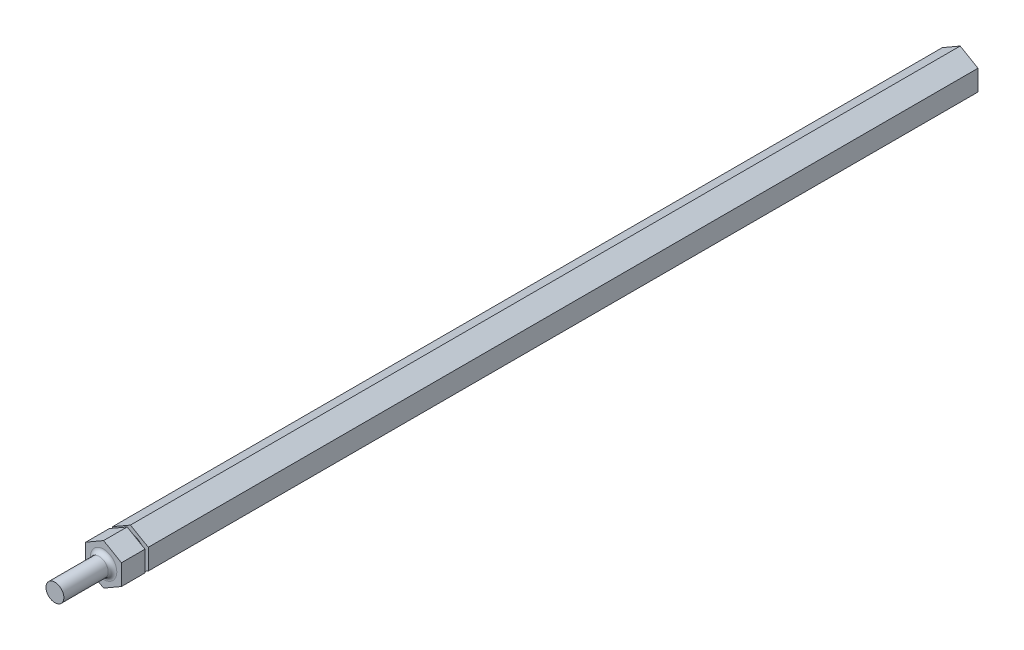
ISO-10303-21;
HEADER;
FILE_DESCRIPTION(('STEP AP214'),'2;1');
FILE_NAME('part.step','',(''),(''),'','','');
FILE_SCHEMA(('AUTOMOTIVE_DESIGN { 1 0 10303 214 1 1 1 1 }'));
ENDSEC;
DATA;
#1=APPLICATION_CONTEXT('core data for automotive mechanical design processes');
#2=APPLICATION_PROTOCOL_DEFINITION('international standard','automotive_design',2000,#1);
#3=PRODUCT_CONTEXT('',#1,'mechanical');
#4=PRODUCT('Part','Part','',(#3));
#5=PRODUCT_RELATED_PRODUCT_CATEGORY('part','',(#4));
#6=PRODUCT_DEFINITION_FORMATION('','',#4);
#7=PRODUCT_DEFINITION_CONTEXT('part definition',#1,'design');
#8=PRODUCT_DEFINITION('design','',#6,#7);
#9=PRODUCT_DEFINITION_SHAPE('','',#8);
#10=(LENGTH_UNIT() NAMED_UNIT(*) SI_UNIT(.MILLI.,.METRE.));
#11=(NAMED_UNIT(*) PLANE_ANGLE_UNIT() SI_UNIT($,.RADIAN.));
#12=(NAMED_UNIT(*) SI_UNIT($,.STERADIAN.) SOLID_ANGLE_UNIT());
#13=UNCERTAINTY_MEASURE_WITH_UNIT(LENGTH_MEASURE(1.E-05),#10,'distance_accuracy_value','');
#14=(GEOMETRIC_REPRESENTATION_CONTEXT(3) GLOBAL_UNCERTAINTY_ASSIGNED_CONTEXT((#13)) GLOBAL_UNIT_ASSIGNED_CONTEXT((#10,
#11,#12)) REPRESENTATION_CONTEXT('',''));
#15=CARTESIAN_POINT('',(0.,0.,0.));
#16=DIRECTION('',(0.,0.,1.));
#17=DIRECTION('',(1.,0.,0.));
#18=AXIS2_PLACEMENT_3D('',#15,#16,#17);
#19=CARTESIAN_POINT('',(0.,7.33234841870825,304.8));
#20=DIRECTION('',(0.5,-0.866025403784439,0.));
#21=DIRECTION('',(0.866025403784438,0.5,0.));
#22=AXIS2_PLACEMENT_3D('',#19,#20,#21);
#23=PLANE('',#22);
#24=DIRECTION('',(0.866025403784438,0.5,0.));
#25=VECTOR('',#24,1.);
#26=CARTESIAN_POINT('',(0.,7.33234841870825,296.418));
#27=LINE('',#26,#25);
#28=CARTESIAN_POINT('',(-6.35,3.66617420935412,296.418));
#29=VERTEX_POINT('',#28);
#30=CARTESIAN_POINT('',(0.,7.33234841870825,296.418));
#31=VERTEX_POINT('',#30);
#32=EDGE_CURVE('E55',#29,#31,#27,.T.);
#33=ORIENTED_EDGE('',*,*,#32,.F.);
#34=DIRECTION('',(0.,0.,-1.));
#35=VECTOR('',#34,1.);
#36=CARTESIAN_POINT('',(-6.35,3.66617420935412,304.8));
#37=LINE('',#36,#35);
#38=CARTESIAN_POINT('',(-6.35,3.66617420935412,304.8));
#39=VERTEX_POINT('',#38);
#40=EDGE_CURVE('E158',#39,#29,#37,.T.);
#41=ORIENTED_EDGE('',*,*,#40,.F.);
#42=DIRECTION('',(-0.866025403784438,-0.5,0.));
#43=VECTOR('',#42,1.);
#44=CARTESIAN_POINT('',(0.,7.33234841870825,304.8));
#45=LINE('',#44,#43);
#46=CARTESIAN_POINT('',(0.,7.33234841870825,304.8));
#47=VERTEX_POINT('',#46);
#48=EDGE_CURVE('E194',#47,#39,#45,.T.);
#49=ORIENTED_EDGE('',*,*,#48,.F.);
#50=DIRECTION('',(0.,0.,-1.));
#51=VECTOR('',#50,1.);
#52=CARTESIAN_POINT('',(0.,7.33234841870825,304.8));
#53=LINE('',#52,#51);
#54=EDGE_CURVE('E145',#47,#31,#53,.T.);
#55=ORIENTED_EDGE('',*,*,#54,.T.);
#56=EDGE_LOOP('',(#33,#41,#49,#55));
#57=FACE_BOUND('',#56,.T.);
#58=ADVANCED_FACE('F33',(#57),#23,.F.);
#59=CARTESIAN_POINT('',(-6.35,3.66617420935412,304.8));
#60=DIRECTION('',(1.,0.,0.));
#61=DIRECTION('',(0.,0.,-1.));
#62=AXIS2_PLACEMENT_3D('',#59,#60,#61);
#63=PLANE('',#62);
#64=DIRECTION('',(0.,1.,0.));
#65=VECTOR('',#64,1.);
#66=CARTESIAN_POINT('',(-6.35,3.66617420935412,296.418));
#67=LINE('',#66,#65);
#68=CARTESIAN_POINT('',(-6.35,-3.66617420935412,296.418));
#69=VERTEX_POINT('',#68);
#70=EDGE_CURVE('E246',#69,#29,#67,.T.);
#71=ORIENTED_EDGE('',*,*,#70,.F.);
#72=DIRECTION('',(0.,0.,-1.));
#73=VECTOR('',#72,1.);
#74=CARTESIAN_POINT('',(-6.35,-3.66617420935412,304.8));
#75=LINE('',#74,#73);
#76=CARTESIAN_POINT('',(-6.35,-3.66617420935412,304.8));
#77=VERTEX_POINT('',#76);
#78=EDGE_CURVE('E154',#77,#69,#75,.T.);
#79=ORIENTED_EDGE('',*,*,#78,.F.);
#80=DIRECTION('',(0.,-1.,0.));
#81=VECTOR('',#80,1.);
#82=CARTESIAN_POINT('',(-6.35,3.66617420935412,304.8));
#83=LINE('',#82,#81);
#84=EDGE_CURVE('E197',#39,#77,#83,.T.);
#85=ORIENTED_EDGE('',*,*,#84,.F.);
#86=ORIENTED_EDGE('',*,*,#40,.T.);
#87=EDGE_LOOP('',(#71,#79,#85,#86));
#88=FACE_BOUND('',#87,.T.);
#89=ADVANCED_FACE('F281',(#88),#63,.F.);
#90=CARTESIAN_POINT('',(-6.35,-3.66617420935412,304.8));
#91=DIRECTION('',(0.5,0.866025403784439,0.));
#92=DIRECTION('',(-0.866025403784438,0.5,0.));
#93=AXIS2_PLACEMENT_3D('',#90,#91,#92);
#94=PLANE('',#93);
#95=DIRECTION('',(-0.866025403784438,0.5,0.));
#96=VECTOR('',#95,1.);
#97=CARTESIAN_POINT('',(-6.35,-3.66617420935412,296.418));
#98=LINE('',#97,#96);
#99=CARTESIAN_POINT('',(0.,-7.33234841870825,296.418));
#100=VERTEX_POINT('',#99);
#101=EDGE_CURVE('E244',#100,#69,#98,.T.);
#102=ORIENTED_EDGE('',*,*,#101,.F.);
#103=DIRECTION('',(0.,0.,-1.));
#104=VECTOR('',#103,1.);
#105=CARTESIAN_POINT('',(0.,-7.33234841870825,304.8));
#106=LINE('',#105,#104);
#107=CARTESIAN_POINT('',(0.,-7.33234841870825,304.8));
#108=VERTEX_POINT('',#107);
#109=EDGE_CURVE('E150',#108,#100,#106,.T.);
#110=ORIENTED_EDGE('',*,*,#109,.F.);
#111=DIRECTION('',(0.866025403784439,-0.5,0.));
#112=VECTOR('',#111,1.);
#113=CARTESIAN_POINT('',(-6.35,-3.66617420935412,304.8));
#114=LINE('',#113,#112);
#115=EDGE_CURVE('E200',#77,#108,#114,.T.);
#116=ORIENTED_EDGE('',*,*,#115,.F.);
#117=ORIENTED_EDGE('',*,*,#78,.T.);
#118=EDGE_LOOP('',(#102,#110,#116,#117));
#119=FACE_BOUND('',#118,.T.);
#120=ADVANCED_FACE('F286',(#119),#94,.F.);
#121=CARTESIAN_POINT('',(0.,-7.33234841870825,304.8));
#122=DIRECTION('',(-0.5,0.866025403784439,0.));
#123=DIRECTION('',(-0.866025403784438,-0.5,0.));
#124=AXIS2_PLACEMENT_3D('',#121,#122,#123);
#125=PLANE('',#124);
#126=DIRECTION('',(-0.866025403784438,-0.5,0.));
#127=VECTOR('',#126,1.);
#128=CARTESIAN_POINT('',(0.,-7.33234841870825,296.418));
#129=LINE('',#128,#127);
#130=CARTESIAN_POINT('',(6.35,-3.66617420935412,296.418));
#131=VERTEX_POINT('',#130);
#132=EDGE_CURVE('E136',#131,#100,#129,.T.);
#133=ORIENTED_EDGE('',*,*,#132,.F.);
#134=DIRECTION('',(0.,0.,-1.));
#135=VECTOR('',#134,1.);
#136=CARTESIAN_POINT('',(6.35,-3.66617420935412,304.8));
#137=LINE('',#136,#135);
#138=CARTESIAN_POINT('',(6.35,-3.66617420935412,304.8));
#139=VERTEX_POINT('',#138);
#140=EDGE_CURVE('E135',#139,#131,#137,.T.);
#141=ORIENTED_EDGE('',*,*,#140,.F.);
#142=DIRECTION('',(0.866025403784438,0.5,0.));
#143=VECTOR('',#142,1.);
#144=CARTESIAN_POINT('',(0.,-7.33234841870825,304.8));
#145=LINE('',#144,#143);
#146=EDGE_CURVE('E202',#108,#139,#145,.T.);
#147=ORIENTED_EDGE('',*,*,#146,.F.);
#148=ORIENTED_EDGE('',*,*,#109,.T.);
#149=EDGE_LOOP('',(#133,#141,#147,#148));
#150=FACE_BOUND('',#149,.T.);
#151=ADVANCED_FACE('F242',(#150),#125,.F.);
#152=CARTESIAN_POINT('',(6.35,-3.66617420935412,304.8));
#153=DIRECTION('',(-1.,0.,0.));
#154=DIRECTION('',(0.,0.,1.));
#155=AXIS2_PLACEMENT_3D('',#152,#153,#154);
#156=PLANE('',#155);
#157=DIRECTION('',(0.,-1.,0.));
#158=VECTOR('',#157,1.);
#159=CARTESIAN_POINT('',(6.35,-3.66617420935412,296.418));
#160=LINE('',#159,#158);
#161=CARTESIAN_POINT('',(6.35,3.66617420935413,296.418));
#162=VERTEX_POINT('',#161);
#163=EDGE_CURVE('E120',#162,#131,#160,.T.);
#164=ORIENTED_EDGE('',*,*,#163,.F.);
#165=DIRECTION('',(0.,0.,-1.));
#166=VECTOR('',#165,1.);
#167=CARTESIAN_POINT('',(6.35,3.66617420935413,304.8));
#168=LINE('',#167,#166);
#169=CARTESIAN_POINT('',(6.35,3.66617420935413,304.8));
#170=VERTEX_POINT('',#169);
#171=EDGE_CURVE('E132',#170,#162,#168,.T.);
#172=ORIENTED_EDGE('',*,*,#171,.F.);
#173=DIRECTION('',(0.,1.,0.));
#174=VECTOR('',#173,1.);
#175=CARTESIAN_POINT('',(6.35,-3.66617420935412,304.8));
#176=LINE('',#175,#174);
#177=EDGE_CURVE('E204',#139,#170,#176,.T.);
#178=ORIENTED_EDGE('',*,*,#177,.F.);
#179=ORIENTED_EDGE('',*,*,#140,.T.);
#180=EDGE_LOOP('',(#164,#172,#178,#179));
#181=FACE_BOUND('',#180,.T.);
#182=ADVANCED_FACE('F130',(#181),#156,.F.);
#183=CARTESIAN_POINT('',(6.35,3.66617420935413,304.8));
#184=DIRECTION('',(-0.5,-0.866025403784439,0.));
#185=DIRECTION('',(0.866025403784439,-0.5,0.));
#186=AXIS2_PLACEMENT_3D('',#183,#184,#185);
#187=PLANE('',#186);
#188=DIRECTION('',(0.866025403784439,-0.5,0.));
#189=VECTOR('',#188,1.);
#190=CARTESIAN_POINT('',(6.35,3.66617420935413,296.418));
#191=LINE('',#190,#189);
#192=EDGE_CURVE('E41',#31,#162,#191,.T.);
#193=ORIENTED_EDGE('',*,*,#192,.F.);
#194=ORIENTED_EDGE('',*,*,#54,.F.);
#195=DIRECTION('',(-0.866025403784439,0.5,0.));
#196=VECTOR('',#195,1.);
#197=CARTESIAN_POINT('',(6.35,3.66617420935413,304.8));
#198=LINE('',#197,#196);
#199=EDGE_CURVE('E140',#170,#47,#198,.T.);
#200=ORIENTED_EDGE('',*,*,#199,.F.);
#201=ORIENTED_EDGE('',*,*,#171,.T.);
#202=EDGE_LOOP('',(#193,#194,#200,#201));
#203=FACE_BOUND('',#202,.T.);
#204=ADVANCED_FACE('F139',(#203),#187,.F.);
#205=CARTESIAN_POINT('',(0.,0.,304.8));
#206=DIRECTION('',(0.,0.,1.));
#207=DIRECTION('',(1.,0.,0.));
#208=AXIS2_PLACEMENT_3D('',#205,#206,#207);
#209=PLANE('',#208);
#210=CARTESIAN_POINT('',(0.,0.,304.8));
#211=DIRECTION('',(0.,0.,1.));
#212=DIRECTION('',(1.,0.,0.));
#213=AXIS2_PLACEMENT_3D('',#210,#211,#212);
#214=CIRCLE('',#213,4.699);
#215=CARTESIAN_POINT('',(4.699,0.,304.8));
#216=VERTEX_POINT('',#215);
#217=EDGE_CURVE('E126',#216,#216,#214,.F.);
#218=ORIENTED_EDGE('',*,*,#217,.T.);
#219=EDGE_LOOP('',(#218));
#220=FACE_BOUND('',#219,.T.);
#221=ORIENTED_EDGE('',*,*,#48,.T.);
#222=ORIENTED_EDGE('',*,*,#84,.T.);
#223=ORIENTED_EDGE('',*,*,#115,.T.);
#224=ORIENTED_EDGE('',*,*,#146,.T.);
#225=ORIENTED_EDGE('',*,*,#177,.T.);
#226=ORIENTED_EDGE('',*,*,#199,.T.);
#227=EDGE_LOOP('',(#221,#222,#223,#224,#225,#226));
#228=FACE_BOUND('',#227,.T.);
#229=ADVANCED_FACE('F167',(#220,#228),#209,.T.);
#230=CARTESIAN_POINT('',(0.,0.,322.1228));
#231=DIRECTION('',(0.,0.,-1.));
#232=DIRECTION('',(-1.,0.,0.));
#233=AXIS2_PLACEMENT_3D('',#230,#231,#232);
#234=CYLINDRICAL_SURFACE('',#233,3.175);
#235=CARTESIAN_POINT('',(0.,0.,306.324));
#236=DIRECTION('',(0.,0.,1.));
#237=DIRECTION('',(1.,0.,0.));
#238=AXIS2_PLACEMENT_3D('',#235,#236,#237);
#239=CIRCLE('',#238,3.175);
#240=CARTESIAN_POINT('',(3.175,0.,306.324));
#241=VERTEX_POINT('',#240);
#242=EDGE_CURVE('E161',#241,#241,#239,.T.);
#243=ORIENTED_EDGE('',*,*,#242,.T.);
#244=EDGE_LOOP('',(#243));
#245=FACE_BOUND('',#244,.T.);
#246=CARTESIAN_POINT('',(0.,0.,322.1228));
#247=DIRECTION('',(0.,0.,1.));
#248=DIRECTION('',(1.,0.,0.));
#249=AXIS2_PLACEMENT_3D('',#246,#247,#248);
#250=CIRCLE('',#249,3.175);
#251=CARTESIAN_POINT('',(3.175,0.,322.1228));
#252=VERTEX_POINT('',#251);
#253=EDGE_CURVE('E182',#252,#252,#250,.T.);
#254=ORIENTED_EDGE('',*,*,#253,.F.);
#255=EDGE_LOOP('',(#254));
#256=FACE_BOUND('',#255,.T.);
#257=ADVANCED_FACE('F176',(#245,#256),#234,.T.);
#258=CARTESIAN_POINT('',(0.,0.,322.1228));
#259=DIRECTION('',(0.,0.,1.));
#260=DIRECTION('',(1.,0.,0.));
#261=AXIS2_PLACEMENT_3D('',#258,#259,#260);
#262=PLANE('',#261);
#263=ORIENTED_EDGE('',*,*,#253,.T.);
#264=EDGE_LOOP('',(#263));
#265=FACE_BOUND('',#264,.T.);
#266=ADVANCED_FACE('F173',(#265),#262,.T.);
#267=CARTESIAN_POINT('',(0.,0.,306.324));
#268=DIRECTION('',(0.,0.,1.));
#269=DIRECTION('',(1.,0.,0.));
#270=AXIS2_PLACEMENT_3D('',#267,#268,#269);
#271=TOROIDAL_SURFACE('',#270,4.699,1.524);
#272=ORIENTED_EDGE('',*,*,#217,.F.);
#273=EDGE_LOOP('',(#272));
#274=FACE_BOUND('',#273,.T.);
#275=ORIENTED_EDGE('',*,*,#242,.F.);
#276=EDGE_LOOP('',(#275));
#277=FACE_BOUND('',#276,.T.);
#278=ADVANCED_FACE('F35',(#274,#277),#271,.F.);
#279=CARTESIAN_POINT('',(-11.3792,0.,295.2496));
#280=DIRECTION('',(0.,0.,1.));
#281=DIRECTION('',(1.,0.,0.));
#282=AXIS2_PLACEMENT_3D('',#279,#280,#281);
#283=PLANE('',#282);
#284=CARTESIAN_POINT('',(0.,0.,295.2496));
#285=DIRECTION('',(0.,0.,1.));
#286=DIRECTION('',(1.,0.,0.));
#287=AXIS2_PLACEMENT_3D('',#284,#285,#286);
#288=CIRCLE('',#287,5.02920000000001);
#289=CARTESIAN_POINT('',(5.02920000000001,0.,295.2496));
#290=VERTEX_POINT('',#289);
#291=EDGE_CURVE('E137',#290,#290,#288,.T.);
#292=ORIENTED_EDGE('',*,*,#291,.F.);
#293=EDGE_LOOP('',(#292));
#294=FACE_BOUND('',#293,.T.);
#295=DIRECTION('',(-0.866025403784438,-0.5,0.));
#296=VECTOR('',#295,1.);
#297=CARTESIAN_POINT('',(0.,7.33234841870825,295.2496));
#298=LINE('',#297,#296);
#299=CARTESIAN_POINT('',(0.,7.33234841870825,295.2496));
#300=VERTEX_POINT('',#299);
#301=CARTESIAN_POINT('',(-6.35,3.66617420935412,295.2496));
#302=VERTEX_POINT('',#301);
#303=EDGE_CURVE('E185',#300,#302,#298,.T.);
#304=ORIENTED_EDGE('',*,*,#303,.T.);
#305=DIRECTION('',(0.,-1.,0.));
#306=VECTOR('',#305,1.);
#307=CARTESIAN_POINT('',(-6.35,3.66617420935412,295.2496));
#308=LINE('',#307,#306);
#309=CARTESIAN_POINT('',(-6.35,-3.66617420935412,295.2496));
#310=VERTEX_POINT('',#309);
#311=EDGE_CURVE('E190',#302,#310,#308,.T.);
#312=ORIENTED_EDGE('',*,*,#311,.T.);
#313=DIRECTION('',(0.866025403784438,-0.5,0.));
#314=VECTOR('',#313,1.);
#315=CARTESIAN_POINT('',(-6.35,-3.66617420935412,295.2496));
#316=LINE('',#315,#314);
#317=CARTESIAN_POINT('',(0.,-7.33234841870825,295.2496));
#318=VERTEX_POINT('',#317);
#319=EDGE_CURVE('E255',#310,#318,#316,.T.);
#320=ORIENTED_EDGE('',*,*,#319,.T.);
#321=DIRECTION('',(0.866025403784438,0.5,0.));
#322=VECTOR('',#321,1.);
#323=CARTESIAN_POINT('',(0.,-7.33234841870825,295.2496));
#324=LINE('',#323,#322);
#325=CARTESIAN_POINT('',(6.35,-3.66617420935412,295.2496));
#326=VERTEX_POINT('',#325);
#327=EDGE_CURVE('E253',#318,#326,#324,.T.);
#328=ORIENTED_EDGE('',*,*,#327,.T.);
#329=DIRECTION('',(0.,1.,0.));
#330=VECTOR('',#329,1.);
#331=CARTESIAN_POINT('',(6.35,-3.66617420935412,295.2496));
#332=LINE('',#331,#330);
#333=CARTESIAN_POINT('',(6.35,3.66617420935413,295.2496));
#334=VERTEX_POINT('',#333);
#335=EDGE_CURVE('E47',#326,#334,#332,.T.);
#336=ORIENTED_EDGE('',*,*,#335,.T.);
#337=DIRECTION('',(-0.866025403784439,0.5,0.));
#338=VECTOR('',#337,1.);
#339=CARTESIAN_POINT('',(6.35,3.66617420935413,295.2496));
#340=LINE('',#339,#338);
#341=EDGE_CURVE('E11',#334,#300,#340,.T.);
#342=ORIENTED_EDGE('',*,*,#341,.T.);
#343=EDGE_LOOP('',(#304,#312,#320,#328,#336,#342));
#344=FACE_BOUND('',#343,.T.);
#345=ADVANCED_FACE('F172',(#294,#344),#283,.T.);
#346=CARTESIAN_POINT('',(-5.02920000000001,0.,296.418));
#347=DIRECTION('',(0.,0.,-1.));
#348=DIRECTION('',(-1.,0.,0.));
#349=AXIS2_PLACEMENT_3D('',#346,#347,#348);
#350=PLANE('',#349);
#351=CARTESIAN_POINT('',(0.,0.,296.418));
#352=DIRECTION('',(0.,0.,1.));
#353=DIRECTION('',(1.,0.,0.));
#354=AXIS2_PLACEMENT_3D('',#351,#352,#353);
#355=CIRCLE('',#354,5.02920000000001);
#356=CARTESIAN_POINT('',(5.02920000000001,0.,296.418));
#357=VERTEX_POINT('',#356);
#358=EDGE_CURVE('E434',#357,#357,#355,.T.);
#359=ORIENTED_EDGE('',*,*,#358,.T.);
#360=EDGE_LOOP('',(#359));
#361=FACE_BOUND('',#360,.T.);
#362=ORIENTED_EDGE('',*,*,#32,.T.);
#363=ORIENTED_EDGE('',*,*,#192,.T.);
#364=ORIENTED_EDGE('',*,*,#163,.T.);
#365=ORIENTED_EDGE('',*,*,#132,.T.);
#366=ORIENTED_EDGE('',*,*,#101,.T.);
#367=ORIENTED_EDGE('',*,*,#70,.T.);
#368=EDGE_LOOP('',(#362,#363,#364,#365,#366,#367));
#369=FACE_BOUND('',#368,.T.);
#370=ADVANCED_FACE('F119',(#361,#369),#350,.T.);
#371=CARTESIAN_POINT('',(0.,0.,330.025304990406));
#372=DIRECTION('',(0.,0.,1.));
#373=DIRECTION('',(1.,0.,0.));
#374=AXIS2_PLACEMENT_3D('',#371,#372,#373);
#375=CYLINDRICAL_SURFACE('',#374,5.02920000000001);
#376=ORIENTED_EDGE('',*,*,#291,.T.);
#377=EDGE_LOOP('',(#376));
#378=FACE_BOUND('',#377,.T.);
#379=ORIENTED_EDGE('',*,*,#358,.F.);
#380=EDGE_LOOP('',(#379));
#381=FACE_BOUND('',#380,.T.);
#382=ADVANCED_FACE('F339',(#378,#381),#375,.T.);
#383=CARTESIAN_POINT('',(0.,0.,0.));
#384=DIRECTION('',(0.,0.,1.));
#385=DIRECTION('',(1.,0.,0.));
#386=AXIS2_PLACEMENT_3D('',#383,#384,#385);
#387=PLANE('',#386);
#388=DIRECTION('',(-0.866025403784438,-0.5,0.));
#389=VECTOR('',#388,1.);
#390=CARTESIAN_POINT('',(0.,7.33234841870825,0.));
#391=LINE('',#390,#389);
#392=CARTESIAN_POINT('',(0.,7.33234841870825,0.));
#393=VERTEX_POINT('',#392);
#394=CARTESIAN_POINT('',(-6.35,3.66617420935412,0.));
#395=VERTEX_POINT('',#394);
#396=EDGE_CURVE('E184',#393,#395,#391,.T.);
#397=ORIENTED_EDGE('',*,*,#396,.F.);
#398=DIRECTION('',(-0.866025403784439,0.5,0.));
#399=VECTOR('',#398,1.);
#400=CARTESIAN_POINT('',(6.35,3.66617420935413,0.));
#401=LINE('',#400,#399);
#402=CARTESIAN_POINT('',(6.35,3.66617420935413,0.));
#403=VERTEX_POINT('',#402);
#404=EDGE_CURVE('E198',#403,#393,#401,.T.);
#405=ORIENTED_EDGE('',*,*,#404,.F.);
#406=DIRECTION('',(0.,1.,0.));
#407=VECTOR('',#406,1.);
#408=CARTESIAN_POINT('',(6.35,-3.66617420935412,0.));
#409=LINE('',#408,#407);
#410=CARTESIAN_POINT('',(6.35,-3.66617420935412,0.));
#411=VERTEX_POINT('',#410);
#412=EDGE_CURVE('E216',#411,#403,#409,.T.);
#413=ORIENTED_EDGE('',*,*,#412,.F.);
#414=DIRECTION('',(0.866025403784438,0.5,0.));
#415=VECTOR('',#414,1.);
#416=CARTESIAN_POINT('',(0.,-7.33234841870825,0.));
#417=LINE('',#416,#415);
#418=CARTESIAN_POINT('',(0.,-7.33234841870825,0.));
#419=VERTEX_POINT('',#418);
#420=EDGE_CURVE('E213',#419,#411,#417,.T.);
#421=ORIENTED_EDGE('',*,*,#420,.F.);
#422=DIRECTION('',(0.866025403784439,-0.5,0.));
#423=VECTOR('',#422,1.);
#424=CARTESIAN_POINT('',(-6.35,-3.66617420935412,0.));
#425=LINE('',#424,#423);
#426=CARTESIAN_POINT('',(-6.35,-3.66617420935412,0.));
#427=VERTEX_POINT('',#426);
#428=EDGE_CURVE('E210',#427,#419,#425,.T.);
#429=ORIENTED_EDGE('',*,*,#428,.F.);
#430=DIRECTION('',(0.,-1.,0.));
#431=VECTOR('',#430,1.);
#432=CARTESIAN_POINT('',(-6.35,3.66617420935412,0.));
#433=LINE('',#432,#431);
#434=EDGE_CURVE('E188',#395,#427,#433,.T.);
#435=ORIENTED_EDGE('',*,*,#434,.F.);
#436=EDGE_LOOP('',(#397,#405,#413,#421,#429,#435));
#437=FACE_BOUND('',#436,.T.);
#438=ADVANCED_FACE('F228',(#437),#387,.F.);
#439=ORIENTED_EDGE('',*,*,#341,.F.);
#440=EDGE_CURVE('E142',#334,#403,#168,.T.);
#441=ORIENTED_EDGE('',*,*,#440,.T.);
#442=ORIENTED_EDGE('',*,*,#404,.T.);
#443=EDGE_CURVE('E206',#300,#393,#53,.T.);
#444=ORIENTED_EDGE('',*,*,#443,.F.);
#445=EDGE_LOOP('',(#439,#441,#442,#444));
#446=FACE_BOUND('',#445,.T.);
#447=ADVANCED_FACE('F223',(#446),#187,.F.);
#448=ORIENTED_EDGE('',*,*,#335,.F.);
#449=EDGE_CURVE('E141',#326,#411,#137,.T.);
#450=ORIENTED_EDGE('',*,*,#449,.T.);
#451=ORIENTED_EDGE('',*,*,#412,.T.);
#452=ORIENTED_EDGE('',*,*,#440,.F.);
#453=EDGE_LOOP('',(#448,#450,#451,#452));
#454=FACE_BOUND('',#453,.T.);
#455=ADVANCED_FACE('F270',(#454),#156,.F.);
#456=ORIENTED_EDGE('',*,*,#327,.F.);
#457=EDGE_CURVE('E149',#318,#419,#106,.T.);
#458=ORIENTED_EDGE('',*,*,#457,.T.);
#459=ORIENTED_EDGE('',*,*,#420,.T.);
#460=ORIENTED_EDGE('',*,*,#449,.F.);
#461=EDGE_LOOP('',(#456,#458,#459,#460));
#462=FACE_BOUND('',#461,.T.);
#463=ADVANCED_FACE('F268',(#462),#125,.F.);
#464=ORIENTED_EDGE('',*,*,#319,.F.);
#465=EDGE_CURVE('E153',#310,#427,#75,.T.);
#466=ORIENTED_EDGE('',*,*,#465,.T.);
#467=ORIENTED_EDGE('',*,*,#428,.T.);
#468=ORIENTED_EDGE('',*,*,#457,.F.);
#469=EDGE_LOOP('',(#464,#466,#467,#468));
#470=FACE_BOUND('',#469,.T.);
#471=ADVANCED_FACE('F263',(#470),#94,.F.);
#472=ORIENTED_EDGE('',*,*,#311,.F.);
#473=EDGE_CURVE('E157',#302,#395,#37,.T.);
#474=ORIENTED_EDGE('',*,*,#473,.T.);
#475=ORIENTED_EDGE('',*,*,#434,.T.);
#476=ORIENTED_EDGE('',*,*,#465,.F.);
#477=EDGE_LOOP('',(#472,#474,#475,#476));
#478=FACE_BOUND('',#477,.T.);
#479=ADVANCED_FACE('F264',(#478),#63,.F.);
#480=ORIENTED_EDGE('',*,*,#303,.F.);
#481=ORIENTED_EDGE('',*,*,#443,.T.);
#482=ORIENTED_EDGE('',*,*,#396,.T.);
#483=ORIENTED_EDGE('',*,*,#473,.F.);
#484=EDGE_LOOP('',(#480,#481,#482,#483));
#485=FACE_BOUND('',#484,.T.);
#486=ADVANCED_FACE('F233',(#485),#23,.F.);
#487=CLOSED_SHELL('',(#58,#89,#120,#151,#182,#204,#229,#257,#266,#278,#345,#370,#382,#438,#447,
#455,#463,#471,#479,#486));
#488=MANIFOLD_SOLID_BREP('B2',#487);
#489=ADVANCED_BREP_SHAPE_REPRESENTATION('',(#18,#488),#14);
#490=SHAPE_DEFINITION_REPRESENTATION(#9,#489);
ENDSEC;
END-ISO-10303-21;
